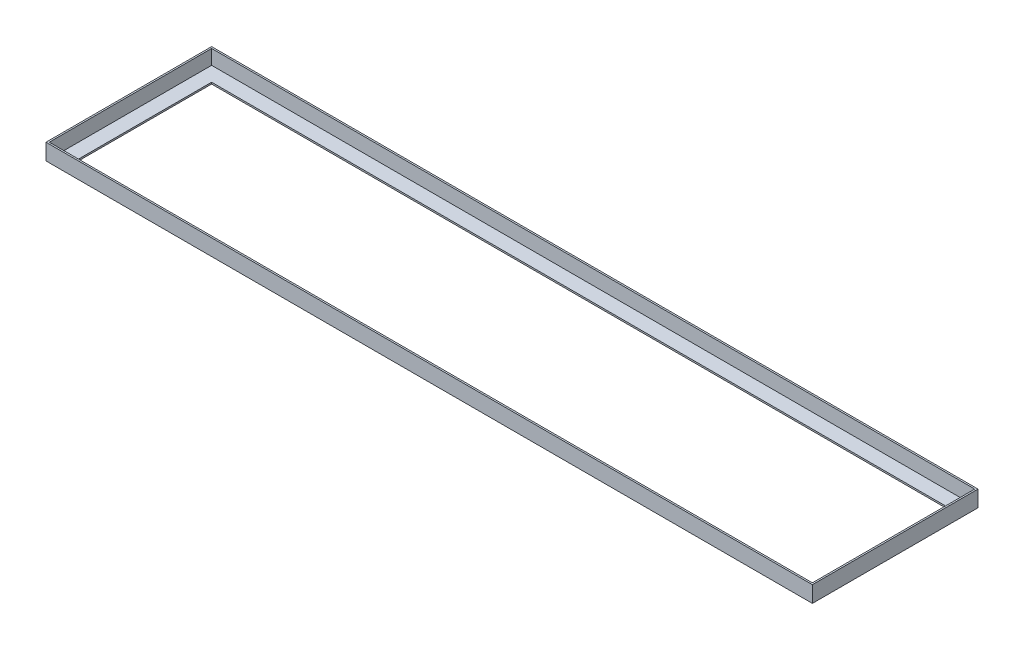
ISO-10303-21;
HEADER;
FILE_DESCRIPTION(('STEP AP214'),'2;1');
FILE_NAME('part.step','',(''),(''),'','','');
FILE_SCHEMA(('AUTOMOTIVE_DESIGN { 1 0 10303 214 1 1 1 1 }'));
ENDSEC;
DATA;
#1=APPLICATION_CONTEXT('core data for automotive mechanical design processes');
#2=APPLICATION_PROTOCOL_DEFINITION('international standard','automotive_design',2000,#1);
#3=PRODUCT_CONTEXT('',#1,'mechanical');
#4=PRODUCT('Part','Part','',(#3));
#5=PRODUCT_RELATED_PRODUCT_CATEGORY('part','',(#4));
#6=PRODUCT_DEFINITION_FORMATION('','',#4);
#7=PRODUCT_DEFINITION_CONTEXT('part definition',#1,'design');
#8=PRODUCT_DEFINITION('design','',#6,#7);
#9=PRODUCT_DEFINITION_SHAPE('','',#8);
#10=(LENGTH_UNIT() NAMED_UNIT(*) SI_UNIT(.MILLI.,.METRE.));
#11=(NAMED_UNIT(*) PLANE_ANGLE_UNIT() SI_UNIT($,.RADIAN.));
#12=(NAMED_UNIT(*) SI_UNIT($,.STERADIAN.) SOLID_ANGLE_UNIT());
#13=UNCERTAINTY_MEASURE_WITH_UNIT(LENGTH_MEASURE(1.E-05),#10,'distance_accuracy_value','');
#14=(GEOMETRIC_REPRESENTATION_CONTEXT(3) GLOBAL_UNCERTAINTY_ASSIGNED_CONTEXT((#13)) GLOBAL_UNIT_ASSIGNED_CONTEXT((#10,
#11,#12)) REPRESENTATION_CONTEXT('',''));
#15=CARTESIAN_POINT('',(0.,0.,0.));
#16=DIRECTION('',(0.,0.,1.));
#17=DIRECTION('',(1.,0.,0.));
#18=AXIS2_PLACEMENT_3D('',#15,#16,#17);
#19=CARTESIAN_POINT('',(-78.9001000112778,15.6650035046458,-204.));
#20=DIRECTION('',(-1.,0.,0.));
#21=DIRECTION('',(0.,0.,1.));
#22=AXIS2_PLACEMENT_3D('',#19,#20,#21);
#23=PLANE('',#22);
#24=DIRECTION('',(0.,-1.,0.));
#25=VECTOR('',#24,1.);
#26=CARTESIAN_POINT('',(-78.9001000112778,15.6650035046458,0.));
#27=LINE('',#26,#25);
#28=CARTESIAN_POINT('',(-78.9001000112778,15.6650035046458,0.));
#29=VERTEX_POINT('',#28);
#30=CARTESIAN_POINT('',(-78.9001000112778,-4.33499649535423,0.));
#31=VERTEX_POINT('',#30);
#32=EDGE_CURVE('E181',#29,#31,#27,.T.);
#33=ORIENTED_EDGE('',*,*,#32,.F.);
#34=DIRECTION('',(0.,0.,1.));
#35=VECTOR('',#34,1.);
#36=CARTESIAN_POINT('',(-78.9001000112778,15.6650035046458,-204.));
#37=LINE('',#36,#35);
#38=CARTESIAN_POINT('',(-78.9001000112778,15.6650035046458,-204.));
#39=VERTEX_POINT('',#38);
#40=EDGE_CURVE('E12',#39,#29,#37,.T.);
#41=ORIENTED_EDGE('',*,*,#40,.F.);
#42=DIRECTION('',(0.,-1.,0.));
#43=VECTOR('',#42,1.);
#44=CARTESIAN_POINT('',(-78.9001000112778,15.6650035046458,-204.));
#45=LINE('',#44,#43);
#46=CARTESIAN_POINT('',(-78.9001000112778,-4.33499649535423,-204.));
#47=VERTEX_POINT('',#46);
#48=EDGE_CURVE('E223',#39,#47,#45,.T.);
#49=ORIENTED_EDGE('',*,*,#48,.T.);
#50=DIRECTION('',(0.,0.,1.));
#51=VECTOR('',#50,1.);
#52=CARTESIAN_POINT('',(-78.9001000112778,-4.33499649535423,-204.));
#53=LINE('',#52,#51);
#54=EDGE_CURVE('E38',#47,#31,#53,.T.);
#55=ORIENTED_EDGE('',*,*,#54,.T.);
#56=EDGE_LOOP('',(#33,#41,#49,#55));
#57=FACE_BOUND('',#56,.T.);
#58=ADVANCED_FACE('F35',(#57),#23,.T.);
#59=CARTESIAN_POINT('',(-78.9001000112778,15.6650035046458,-204.));
#60=DIRECTION('',(0.,1.,0.));
#61=DIRECTION('',(0.,0.,1.));
#62=AXIS2_PLACEMENT_3D('',#59,#60,#61);
#63=PLANE('',#62);
#64=DIRECTION('',(1.,0.,0.));
#65=VECTOR('',#64,1.);
#66=CARTESIAN_POINT('',(863.099899988722,15.6650035046458,-202.));
#67=LINE('',#66,#65);
#68=CARTESIAN_POINT('',(-76.9001000112777,15.6650035046458,-202.));
#69=VERTEX_POINT('',#68);
#70=CARTESIAN_POINT('',(863.099899988722,15.6650035046458,-202.));
#71=VERTEX_POINT('',#70);
#72=EDGE_CURVE('E170',#69,#71,#67,.T.);
#73=ORIENTED_EDGE('',*,*,#72,.T.);
#74=DIRECTION('',(0.,0.,1.));
#75=VECTOR('',#74,1.);
#76=CARTESIAN_POINT('',(863.099899988722,15.6650035046458,-202.));
#77=LINE('',#76,#75);
#78=CARTESIAN_POINT('',(863.099899988722,15.6650035046458,-2.00000000000003));
#79=VERTEX_POINT('',#78);
#80=EDGE_CURVE('E178',#71,#79,#77,.T.);
#81=ORIENTED_EDGE('',*,*,#80,.T.);
#82=DIRECTION('',(-1.,0.,0.));
#83=VECTOR('',#82,1.);
#84=CARTESIAN_POINT('',(863.099899988722,15.6650035046458,-2.));
#85=LINE('',#84,#83);
#86=CARTESIAN_POINT('',(-76.9001000112777,15.6650035046458,-2.00000000000002));
#87=VERTEX_POINT('',#86);
#88=EDGE_CURVE('E188',#79,#87,#85,.T.);
#89=ORIENTED_EDGE('',*,*,#88,.T.);
#90=DIRECTION('',(0.,0.,-1.));
#91=VECTOR('',#90,1.);
#92=CARTESIAN_POINT('',(-76.9001000112778,15.6650035046458,-202.));
#93=LINE('',#92,#91);
#94=EDGE_CURVE('E204',#87,#69,#93,.T.);
#95=ORIENTED_EDGE('',*,*,#94,.T.);
#96=EDGE_LOOP('',(#73,#81,#89,#95));
#97=FACE_BOUND('',#96,.T.);
#98=DIRECTION('',(-1.,0.,0.));
#99=VECTOR('',#98,1.);
#100=CARTESIAN_POINT('',(-78.9001000112778,15.6650035046458,0.));
#101=LINE('',#100,#99);
#102=CARTESIAN_POINT('',(865.099899988722,15.6650035046458,0.));
#103=VERTEX_POINT('',#102);
#104=EDGE_CURVE('E227',#103,#29,#101,.T.);
#105=ORIENTED_EDGE('',*,*,#104,.F.);
#106=DIRECTION('',(0.,0.,1.));
#107=VECTOR('',#106,1.);
#108=CARTESIAN_POINT('',(865.099899988722,15.6650035046458,-204.));
#109=LINE('',#108,#107);
#110=CARTESIAN_POINT('',(865.099899988722,15.6650035046458,-204.));
#111=VERTEX_POINT('',#110);
#112=EDGE_CURVE('E43',#111,#103,#109,.T.);
#113=ORIENTED_EDGE('',*,*,#112,.F.);
#114=DIRECTION('',(-1.,0.,0.));
#115=VECTOR('',#114,1.);
#116=CARTESIAN_POINT('',(-78.9001000112778,15.6650035046458,-204.));
#117=LINE('',#116,#115);
#118=EDGE_CURVE('E233',#111,#39,#117,.T.);
#119=ORIENTED_EDGE('',*,*,#118,.T.);
#120=ORIENTED_EDGE('',*,*,#40,.T.);
#121=EDGE_LOOP('',(#105,#113,#119,#120));
#122=FACE_BOUND('',#121,.T.);
#123=ADVANCED_FACE('F257',(#97,#122),#63,.T.);
#124=CARTESIAN_POINT('',(865.099899988722,15.6650035046458,-204.));
#125=DIRECTION('',(1.,0.,0.));
#126=DIRECTION('',(0.,0.,-1.));
#127=AXIS2_PLACEMENT_3D('',#124,#125,#126);
#128=PLANE('',#127);
#129=DIRECTION('',(0.,1.,0.));
#130=VECTOR('',#129,1.);
#131=CARTESIAN_POINT('',(865.099899988722,15.6650035046458,0.));
#132=LINE('',#131,#130);
#133=CARTESIAN_POINT('',(865.099899988722,-4.33499649535423,0.));
#134=VERTEX_POINT('',#133);
#135=EDGE_CURVE('E241',#134,#103,#132,.T.);
#136=ORIENTED_EDGE('',*,*,#135,.F.);
#137=DIRECTION('',(0.,0.,1.));
#138=VECTOR('',#137,1.);
#139=CARTESIAN_POINT('',(865.099899988722,-4.33499649535423,-204.));
#140=LINE('',#139,#138);
#141=CARTESIAN_POINT('',(865.099899988722,-4.33499649535423,-204.));
#142=VERTEX_POINT('',#141);
#143=EDGE_CURVE('E246',#142,#134,#140,.T.);
#144=ORIENTED_EDGE('',*,*,#143,.F.);
#145=DIRECTION('',(0.,1.,0.));
#146=VECTOR('',#145,1.);
#147=CARTESIAN_POINT('',(865.099899988722,15.6650035046458,-204.));
#148=LINE('',#147,#146);
#149=EDGE_CURVE('E230',#142,#111,#148,.T.);
#150=ORIENTED_EDGE('',*,*,#149,.T.);
#151=ORIENTED_EDGE('',*,*,#112,.T.);
#152=EDGE_LOOP('',(#136,#144,#150,#151));
#153=FACE_BOUND('',#152,.T.);
#154=ADVANCED_FACE('F263',(#153),#128,.T.);
#155=CARTESIAN_POINT('',(-78.9001000112778,-4.33499649535423,-204.));
#156=DIRECTION('',(0.,-1.,0.));
#157=DIRECTION('',(1.,0.,0.));
#158=AXIS2_PLACEMENT_3D('',#155,#156,#157);
#159=PLANE('',#158);
#160=DIRECTION('',(-1.,0.,0.));
#161=VECTOR('',#160,1.);
#162=CARTESIAN_POINT('',(845.099899988722,-4.33499649535428,-20.));
#163=LINE('',#162,#161);
#164=CARTESIAN_POINT('',(845.099899988722,-4.33499649535428,-20.));
#165=VERTEX_POINT('',#164);
#166=CARTESIAN_POINT('',(-58.9001000112778,-4.33499649535423,-20.));
#167=VERTEX_POINT('',#166);
#168=EDGE_CURVE('E163',#165,#167,#163,.T.);
#169=ORIENTED_EDGE('',*,*,#168,.F.);
#170=DIRECTION('',(0.,0.,1.));
#171=VECTOR('',#170,1.);
#172=CARTESIAN_POINT('',(845.099899988722,-4.33499649535428,-184.));
#173=LINE('',#172,#171);
#174=CARTESIAN_POINT('',(845.099899988722,-4.33499649535428,-184.));
#175=VERTEX_POINT('',#174);
#176=EDGE_CURVE('E140',#175,#165,#173,.T.);
#177=ORIENTED_EDGE('',*,*,#176,.F.);
#178=DIRECTION('',(1.,0.,0.));
#179=VECTOR('',#178,1.);
#180=CARTESIAN_POINT('',(-58.9001000112778,-4.33499649535428,-184.));
#181=LINE('',#180,#179);
#182=CARTESIAN_POINT('',(-58.9001000112778,-4.33499649535428,-184.));
#183=VERTEX_POINT('',#182);
#184=EDGE_CURVE('E132',#183,#175,#181,.T.);
#185=ORIENTED_EDGE('',*,*,#184,.F.);
#186=DIRECTION('',(0.,0.,-1.));
#187=VECTOR('',#186,1.);
#188=CARTESIAN_POINT('',(-58.9001000112778,-4.33499649535428,-20.));
#189=LINE('',#188,#187);
#190=EDGE_CURVE('E121',#167,#183,#189,.T.);
#191=ORIENTED_EDGE('',*,*,#190,.F.);
#192=EDGE_LOOP('',(#169,#177,#185,#191));
#193=FACE_BOUND('',#192,.T.);
#194=DIRECTION('',(1.,0.,0.));
#195=VECTOR('',#194,1.);
#196=CARTESIAN_POINT('',(-78.9001000112778,-4.33499649535423,0.));
#197=LINE('',#196,#195);
#198=EDGE_CURVE('E238',#31,#134,#197,.T.);
#199=ORIENTED_EDGE('',*,*,#198,.F.);
#200=ORIENTED_EDGE('',*,*,#54,.F.);
#201=DIRECTION('',(1.,0.,0.));
#202=VECTOR('',#201,1.);
#203=CARTESIAN_POINT('',(-78.9001000112778,-4.33499649535423,-204.));
#204=LINE('',#203,#202);
#205=EDGE_CURVE('E226',#47,#142,#204,.T.);
#206=ORIENTED_EDGE('',*,*,#205,.T.);
#207=ORIENTED_EDGE('',*,*,#143,.T.);
#208=EDGE_LOOP('',(#199,#200,#206,#207));
#209=FACE_BOUND('',#208,.T.);
#210=ADVANCED_FACE('F138',(#193,#209),#159,.T.);
#211=CARTESIAN_POINT('',(0.,0.,-204.));
#212=DIRECTION('',(0.,0.,1.));
#213=DIRECTION('',(1.,0.,0.));
#214=AXIS2_PLACEMENT_3D('',#211,#212,#213);
#215=PLANE('',#214);
#216=ORIENTED_EDGE('',*,*,#48,.F.);
#217=ORIENTED_EDGE('',*,*,#118,.F.);
#218=ORIENTED_EDGE('',*,*,#149,.F.);
#219=ORIENTED_EDGE('',*,*,#205,.F.);
#220=EDGE_LOOP('',(#216,#217,#218,#219));
#221=FACE_BOUND('',#220,.T.);
#222=ADVANCED_FACE('F260',(#221),#215,.F.);
#223=CARTESIAN_POINT('',(0.,0.,0.));
#224=DIRECTION('',(0.,0.,1.));
#225=DIRECTION('',(1.,0.,0.));
#226=AXIS2_PLACEMENT_3D('',#223,#224,#225);
#227=PLANE('',#226);
#228=ORIENTED_EDGE('',*,*,#32,.T.);
#229=ORIENTED_EDGE('',*,*,#198,.T.);
#230=ORIENTED_EDGE('',*,*,#135,.T.);
#231=ORIENTED_EDGE('',*,*,#104,.T.);
#232=EDGE_LOOP('',(#228,#229,#230,#231));
#233=FACE_BOUND('',#232,.T.);
#234=ADVANCED_FACE('F254',(#233),#227,.T.);
#235=CARTESIAN_POINT('',(0.,-2.33499649535428,0.));
#236=DIRECTION('',(0.,-1.,0.));
#237=DIRECTION('',(0.,0.,-1.));
#238=AXIS2_PLACEMENT_3D('',#235,#236,#237);
#239=PLANE('',#238);
#240=DIRECTION('',(0.,0.,1.));
#241=VECTOR('',#240,1.);
#242=CARTESIAN_POINT('',(845.099899988722,-2.33499649535428,-184.));
#243=LINE('',#242,#241);
#244=CARTESIAN_POINT('',(845.099899988722,-2.33499649535428,-184.));
#245=VERTEX_POINT('',#244);
#246=CARTESIAN_POINT('',(845.099899988722,-2.33499649535428,-20.));
#247=VERTEX_POINT('',#246);
#248=EDGE_CURVE('E141',#245,#247,#243,.T.);
#249=ORIENTED_EDGE('',*,*,#248,.T.);
#250=DIRECTION('',(-1.,0.,0.));
#251=VECTOR('',#250,1.);
#252=CARTESIAN_POINT('',(845.099899988722,-2.33499649535428,-20.));
#253=LINE('',#252,#251);
#254=CARTESIAN_POINT('',(-58.9001000112778,-2.33499649535428,-20.));
#255=VERTEX_POINT('',#254);
#256=EDGE_CURVE('E162',#247,#255,#253,.T.);
#257=ORIENTED_EDGE('',*,*,#256,.T.);
#258=DIRECTION('',(0.,0.,-1.));
#259=VECTOR('',#258,1.);
#260=CARTESIAN_POINT('',(-58.9001000112778,-2.33499649535428,-20.));
#261=LINE('',#260,#259);
#262=CARTESIAN_POINT('',(-58.9001000112778,-2.33499649535428,-184.));
#263=VERTEX_POINT('',#262);
#264=EDGE_CURVE('E126',#255,#263,#261,.T.);
#265=ORIENTED_EDGE('',*,*,#264,.T.);
#266=DIRECTION('',(1.,0.,0.));
#267=VECTOR('',#266,1.);
#268=CARTESIAN_POINT('',(-58.9001000112778,-2.33499649535428,-184.));
#269=LINE('',#268,#267);
#270=EDGE_CURVE('E127',#263,#245,#269,.T.);
#271=ORIENTED_EDGE('',*,*,#270,.T.);
#272=EDGE_LOOP('',(#249,#257,#265,#271));
#273=FACE_BOUND('',#272,.T.);
#274=DIRECTION('',(1.,0.,0.));
#275=VECTOR('',#274,1.);
#276=CARTESIAN_POINT('',(863.099899988722,-2.33499649535423,-202.));
#277=LINE('',#276,#275);
#278=CARTESIAN_POINT('',(-76.9001000112777,-2.33499649535423,-202.));
#279=VERTEX_POINT('',#278);
#280=CARTESIAN_POINT('',(863.099899988722,-2.33499649535423,-202.));
#281=VERTEX_POINT('',#280);
#282=EDGE_CURVE('E196',#279,#281,#277,.T.);
#283=ORIENTED_EDGE('',*,*,#282,.F.);
#284=DIRECTION('',(0.,0.,-1.));
#285=VECTOR('',#284,1.);
#286=CARTESIAN_POINT('',(-76.9001000112778,-2.33499649535423,-202.));
#287=LINE('',#286,#285);
#288=CARTESIAN_POINT('',(-76.9001000112777,-2.33499649535423,-2.00000000000002));
#289=VERTEX_POINT('',#288);
#290=EDGE_CURVE('E169',#289,#279,#287,.T.);
#291=ORIENTED_EDGE('',*,*,#290,.F.);
#292=DIRECTION('',(-1.,0.,0.));
#293=VECTOR('',#292,1.);
#294=CARTESIAN_POINT('',(863.099899988722,-2.33499649535423,-2.));
#295=LINE('',#294,#293);
#296=CARTESIAN_POINT('',(863.099899988722,-2.33499649535423,-2.00000000000002));
#297=VERTEX_POINT('',#296);
#298=EDGE_CURVE('E189',#297,#289,#295,.T.);
#299=ORIENTED_EDGE('',*,*,#298,.F.);
#300=DIRECTION('',(0.,0.,1.));
#301=VECTOR('',#300,1.);
#302=CARTESIAN_POINT('',(863.099899988722,-2.33499649535423,-202.));
#303=LINE('',#302,#301);
#304=EDGE_CURVE('E182',#281,#297,#303,.T.);
#305=ORIENTED_EDGE('',*,*,#304,.F.);
#306=EDGE_LOOP('',(#283,#291,#299,#305));
#307=FACE_BOUND('',#306,.T.);
#308=ADVANCED_FACE('F296',(#273,#307),#239,.F.);
#309=CARTESIAN_POINT('',(863.099899988722,15.6650035046458,-202.));
#310=DIRECTION('',(0.,0.,-1.));
#311=DIRECTION('',(-1.,0.,0.));
#312=AXIS2_PLACEMENT_3D('',#309,#310,#311);
#313=PLANE('',#312);
#314=ORIENTED_EDGE('',*,*,#282,.T.);
#315=DIRECTION('',(0.,-1.,0.));
#316=VECTOR('',#315,1.);
#317=CARTESIAN_POINT('',(863.099899988722,15.6650035046458,-202.));
#318=LINE('',#317,#316);
#319=EDGE_CURVE('E166',#71,#281,#318,.T.);
#320=ORIENTED_EDGE('',*,*,#319,.F.);
#321=ORIENTED_EDGE('',*,*,#72,.F.);
#322=DIRECTION('',(0.,-1.,0.));
#323=VECTOR('',#322,1.);
#324=CARTESIAN_POINT('',(-76.9001000112778,15.6650035046458,-202.));
#325=LINE('',#324,#323);
#326=EDGE_CURVE('E175',#69,#279,#325,.T.);
#327=ORIENTED_EDGE('',*,*,#326,.T.);
#328=EDGE_LOOP('',(#314,#320,#321,#327));
#329=FACE_BOUND('',#328,.T.);
#330=ADVANCED_FACE('F290',(#329),#313,.F.);
#331=CARTESIAN_POINT('',(-76.9001000112778,15.6650035046458,-202.));
#332=DIRECTION('',(-1.,0.,0.));
#333=DIRECTION('',(0.,0.,1.));
#334=AXIS2_PLACEMENT_3D('',#331,#332,#333);
#335=PLANE('',#334);
#336=ORIENTED_EDGE('',*,*,#290,.T.);
#337=ORIENTED_EDGE('',*,*,#326,.F.);
#338=ORIENTED_EDGE('',*,*,#94,.F.);
#339=DIRECTION('',(0.,-1.,0.));
#340=VECTOR('',#339,1.);
#341=CARTESIAN_POINT('',(-76.9001000112778,15.6650035046458,-2.));
#342=LINE('',#341,#340);
#343=EDGE_CURVE('E207',#87,#289,#342,.T.);
#344=ORIENTED_EDGE('',*,*,#343,.T.);
#345=EDGE_LOOP('',(#336,#337,#338,#344));
#346=FACE_BOUND('',#345,.T.);
#347=ADVANCED_FACE('F295',(#346),#335,.F.);
#348=CARTESIAN_POINT('',(863.099899988722,15.6650035046458,-2.));
#349=DIRECTION('',(0.,0.,1.));
#350=DIRECTION('',(1.,0.,0.));
#351=AXIS2_PLACEMENT_3D('',#348,#349,#350);
#352=PLANE('',#351);
#353=ORIENTED_EDGE('',*,*,#298,.T.);
#354=ORIENTED_EDGE('',*,*,#343,.F.);
#355=ORIENTED_EDGE('',*,*,#88,.F.);
#356=DIRECTION('',(0.,-1.,0.));
#357=VECTOR('',#356,1.);
#358=CARTESIAN_POINT('',(863.099899988722,15.6650035046458,-2.));
#359=LINE('',#358,#357);
#360=EDGE_CURVE('E185',#79,#297,#359,.T.);
#361=ORIENTED_EDGE('',*,*,#360,.T.);
#362=EDGE_LOOP('',(#353,#354,#355,#361));
#363=FACE_BOUND('',#362,.T.);
#364=ADVANCED_FACE('F308',(#363),#352,.F.);
#365=CARTESIAN_POINT('',(863.099899988722,15.6650035046458,-202.));
#366=DIRECTION('',(1.,0.,0.));
#367=DIRECTION('',(0.,0.,-1.));
#368=AXIS2_PLACEMENT_3D('',#365,#366,#367);
#369=PLANE('',#368);
#370=ORIENTED_EDGE('',*,*,#304,.T.);
#371=ORIENTED_EDGE('',*,*,#360,.F.);
#372=ORIENTED_EDGE('',*,*,#80,.F.);
#373=ORIENTED_EDGE('',*,*,#319,.T.);
#374=EDGE_LOOP('',(#370,#371,#372,#373));
#375=FACE_BOUND('',#374,.T.);
#376=ADVANCED_FACE('F318',(#375),#369,.F.);
#377=CARTESIAN_POINT('',(845.099899988722,-2.33499649535428,-20.));
#378=DIRECTION('',(0.,0.,1.));
#379=DIRECTION('',(1.,0.,0.));
#380=AXIS2_PLACEMENT_3D('',#377,#378,#379);
#381=PLANE('',#380);
#382=ORIENTED_EDGE('',*,*,#168,.T.);
#383=DIRECTION('',(0.,-1.,0.));
#384=VECTOR('',#383,1.);
#385=CARTESIAN_POINT('',(-58.9001000112778,-2.33499649535428,-20.));
#386=LINE('',#385,#384);
#387=EDGE_CURVE('E56',#255,#167,#386,.T.);
#388=ORIENTED_EDGE('',*,*,#387,.F.);
#389=ORIENTED_EDGE('',*,*,#256,.F.);
#390=DIRECTION('',(0.,-1.,0.));
#391=VECTOR('',#390,1.);
#392=CARTESIAN_POINT('',(845.099899988722,-2.33499649535428,-20.));
#393=LINE('',#392,#391);
#394=EDGE_CURVE('E159',#247,#165,#393,.T.);
#395=ORIENTED_EDGE('',*,*,#394,.T.);
#396=EDGE_LOOP('',(#382,#388,#389,#395));
#397=FACE_BOUND('',#396,.T.);
#398=ADVANCED_FACE('F328',(#397),#381,.F.);
#399=CARTESIAN_POINT('',(845.099899988722,-2.33499649535428,-184.));
#400=DIRECTION('',(1.,0.,0.));
#401=DIRECTION('',(0.,0.,-1.));
#402=AXIS2_PLACEMENT_3D('',#399,#400,#401);
#403=PLANE('',#402);
#404=ORIENTED_EDGE('',*,*,#176,.T.);
#405=ORIENTED_EDGE('',*,*,#394,.F.);
#406=ORIENTED_EDGE('',*,*,#248,.F.);
#407=DIRECTION('',(0.,-1.,0.));
#408=VECTOR('',#407,1.);
#409=CARTESIAN_POINT('',(845.099899988722,-2.33499649535428,-184.));
#410=LINE('',#409,#408);
#411=EDGE_CURVE('E144',#245,#175,#410,.T.);
#412=ORIENTED_EDGE('',*,*,#411,.T.);
#413=EDGE_LOOP('',(#404,#405,#406,#412));
#414=FACE_BOUND('',#413,.T.);
#415=ADVANCED_FACE('F353',(#414),#403,.F.);
#416=CARTESIAN_POINT('',(-58.9001000112778,-2.33499649535428,-184.));
#417=DIRECTION('',(0.,0.,-1.));
#418=DIRECTION('',(-1.,0.,0.));
#419=AXIS2_PLACEMENT_3D('',#416,#417,#418);
#420=PLANE('',#419);
#421=ORIENTED_EDGE('',*,*,#184,.T.);
#422=ORIENTED_EDGE('',*,*,#411,.F.);
#423=ORIENTED_EDGE('',*,*,#270,.F.);
#424=DIRECTION('',(0.,-1.,0.));
#425=VECTOR('',#424,1.);
#426=CARTESIAN_POINT('',(-58.9001000112778,-2.33499649535428,-184.));
#427=LINE('',#426,#425);
#428=EDGE_CURVE('E51',#263,#183,#427,.T.);
#429=ORIENTED_EDGE('',*,*,#428,.T.);
#430=EDGE_LOOP('',(#421,#422,#423,#429));
#431=FACE_BOUND('',#430,.T.);
#432=ADVANCED_FACE('F130',(#431),#420,.F.);
#433=CARTESIAN_POINT('',(-58.9001000112778,-2.33499649535428,-20.));
#434=DIRECTION('',(-1.,0.,0.));
#435=DIRECTION('',(0.,0.,1.));
#436=AXIS2_PLACEMENT_3D('',#433,#434,#435);
#437=PLANE('',#436);
#438=ORIENTED_EDGE('',*,*,#190,.T.);
#439=ORIENTED_EDGE('',*,*,#428,.F.);
#440=ORIENTED_EDGE('',*,*,#264,.F.);
#441=ORIENTED_EDGE('',*,*,#387,.T.);
#442=EDGE_LOOP('',(#438,#439,#440,#441));
#443=FACE_BOUND('',#442,.T.);
#444=ADVANCED_FACE('F122',(#443),#437,.F.);
#445=CLOSED_SHELL('',(#58,#123,#154,#210,#222,#234,#308,#330,#347,#364,#376,#398,#415,#432,#444));
#446=MANIFOLD_SOLID_BREP('B2',#445);
#447=ADVANCED_BREP_SHAPE_REPRESENTATION('',(#18,#446),#14);
#448=SHAPE_DEFINITION_REPRESENTATION(#9,#447);
ENDSEC;
END-ISO-10303-21;
